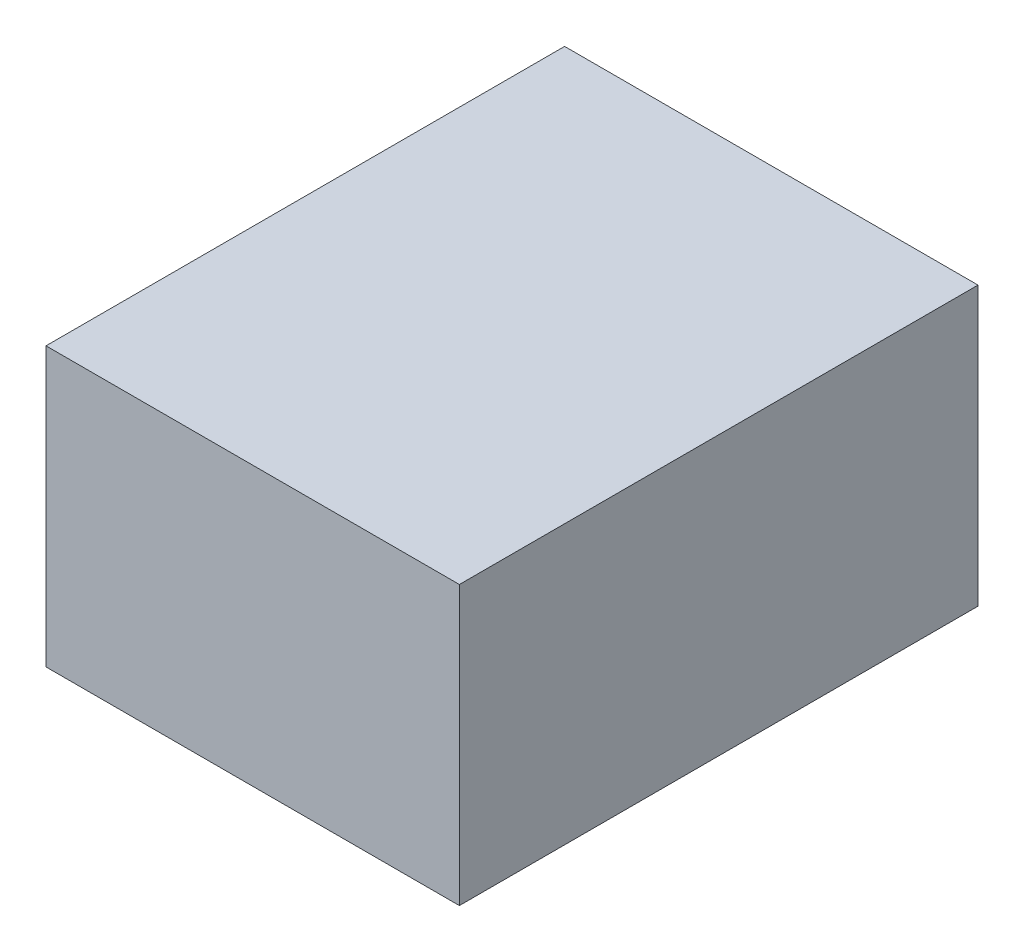
ISO-10303-21;
HEADER;
FILE_DESCRIPTION(('STEP AP214'),'2;1');
FILE_NAME('part.step','',(''),(''),'','','');
FILE_SCHEMA(('AUTOMOTIVE_DESIGN { 1 0 10303 214 1 1 1 1 }'));
ENDSEC;
DATA;
#1=APPLICATION_CONTEXT('core data for automotive mechanical design processes');
#2=APPLICATION_PROTOCOL_DEFINITION('international standard','automotive_design',2000,#1);
#3=PRODUCT_CONTEXT('',#1,'mechanical');
#4=PRODUCT('Part','Part','',(#3));
#5=PRODUCT_RELATED_PRODUCT_CATEGORY('part','',(#4));
#6=PRODUCT_DEFINITION_FORMATION('','',#4);
#7=PRODUCT_DEFINITION_CONTEXT('part definition',#1,'design');
#8=PRODUCT_DEFINITION('design','',#6,#7);
#9=PRODUCT_DEFINITION_SHAPE('','',#8);
#10=(LENGTH_UNIT() NAMED_UNIT(*) SI_UNIT(.MILLI.,.METRE.));
#11=(NAMED_UNIT(*) PLANE_ANGLE_UNIT() SI_UNIT($,.RADIAN.));
#12=(NAMED_UNIT(*) SI_UNIT($,.STERADIAN.) SOLID_ANGLE_UNIT());
#13=UNCERTAINTY_MEASURE_WITH_UNIT(LENGTH_MEASURE(1.E-05),#10,'distance_accuracy_value','');
#14=(GEOMETRIC_REPRESENTATION_CONTEXT(3) GLOBAL_UNCERTAINTY_ASSIGNED_CONTEXT((#13)) GLOBAL_UNIT_ASSIGNED_CONTEXT((#10,
#11,#12)) REPRESENTATION_CONTEXT('',''));
#15=CARTESIAN_POINT('',(0.,0.,0.));
#16=DIRECTION('',(0.,0.,1.));
#17=DIRECTION('',(1.,0.,0.));
#18=AXIS2_PLACEMENT_3D('',#15,#16,#17);
#19=CARTESIAN_POINT('',(-27.5,-18.5,69.));
#20=DIRECTION('',(1.,0.,0.));
#21=DIRECTION('',(0.,1.,0.));
#22=AXIS2_PLACEMENT_3D('',#19,#20,#21);
#23=PLANE('',#22);
#24=DIRECTION('',(0.,-1.,0.));
#25=VECTOR('',#24,1.);
#26=CARTESIAN_POINT('',(-27.5,-18.5,0.));
#27=LINE('',#26,#25);
#28=CARTESIAN_POINT('',(-27.5,18.5,0.));
#29=VERTEX_POINT('',#28);
#30=CARTESIAN_POINT('',(-27.5,-18.5,0.));
#31=VERTEX_POINT('',#30);
#32=EDGE_CURVE('E100',#29,#31,#27,.T.);
#33=ORIENTED_EDGE('',*,*,#32,.T.);
#34=DIRECTION('',(0.,0.,-1.));
#35=VECTOR('',#34,1.);
#36=CARTESIAN_POINT('',(-27.5,-18.5,69.));
#37=LINE('',#36,#35);
#38=CARTESIAN_POINT('',(-27.5,-18.5,69.));
#39=VERTEX_POINT('',#38);
#40=EDGE_CURVE('E11',#39,#31,#37,.T.);
#41=ORIENTED_EDGE('',*,*,#40,.F.);
#42=DIRECTION('',(0.,-1.,0.));
#43=VECTOR('',#42,1.);
#44=CARTESIAN_POINT('',(-27.5,-18.5,69.));
#45=LINE('',#44,#43);
#46=CARTESIAN_POINT('',(-27.5,18.5,69.));
#47=VERTEX_POINT('',#46);
#48=EDGE_CURVE('E88',#47,#39,#45,.T.);
#49=ORIENTED_EDGE('',*,*,#48,.F.);
#50=DIRECTION('',(0.,0.,-1.));
#51=VECTOR('',#50,1.);
#52=CARTESIAN_POINT('',(-27.5,18.5,69.));
#53=LINE('',#52,#51);
#54=EDGE_CURVE('E96',#47,#29,#53,.T.);
#55=ORIENTED_EDGE('',*,*,#54,.T.);
#56=EDGE_LOOP('',(#33,#41,#49,#55));
#57=FACE_BOUND('',#56,.T.);
#58=ADVANCED_FACE('F37',(#57),#23,.F.);
#59=CARTESIAN_POINT('',(27.5,-18.5,69.));
#60=DIRECTION('',(0.,1.,0.));
#61=DIRECTION('',(-1.,0.,0.));
#62=AXIS2_PLACEMENT_3D('',#59,#60,#61);
#63=PLANE('',#62);
#64=DIRECTION('',(1.,0.,0.));
#65=VECTOR('',#64,1.);
#66=CARTESIAN_POINT('',(27.5,-18.5,0.));
#67=LINE('',#66,#65);
#68=CARTESIAN_POINT('',(27.5,-18.5,0.));
#69=VERTEX_POINT('',#68);
#70=EDGE_CURVE('E92',#31,#69,#67,.T.);
#71=ORIENTED_EDGE('',*,*,#70,.T.);
#72=DIRECTION('',(0.,0.,-1.));
#73=VECTOR('',#72,1.);
#74=CARTESIAN_POINT('',(27.5,-18.5,69.));
#75=LINE('',#74,#73);
#76=CARTESIAN_POINT('',(27.5,-18.5,69.));
#77=VERTEX_POINT('',#76);
#78=EDGE_CURVE('E45',#77,#69,#75,.T.);
#79=ORIENTED_EDGE('',*,*,#78,.F.);
#80=DIRECTION('',(1.,0.,0.));
#81=VECTOR('',#80,1.);
#82=CARTESIAN_POINT('',(27.5,-18.5,69.));
#83=LINE('',#82,#81);
#84=EDGE_CURVE('E83',#39,#77,#83,.T.);
#85=ORIENTED_EDGE('',*,*,#84,.F.);
#86=ORIENTED_EDGE('',*,*,#40,.T.);
#87=EDGE_LOOP('',(#71,#79,#85,#86));
#88=FACE_BOUND('',#87,.T.);
#89=ADVANCED_FACE('F91',(#88),#63,.F.);
#90=CARTESIAN_POINT('',(27.5,-18.5,69.));
#91=DIRECTION('',(-1.,0.,0.));
#92=DIRECTION('',(0.,0.,1.));
#93=AXIS2_PLACEMENT_3D('',#90,#91,#92);
#94=PLANE('',#93);
#95=DIRECTION('',(0.,1.,0.));
#96=VECTOR('',#95,1.);
#97=CARTESIAN_POINT('',(27.5,-18.5,0.));
#98=LINE('',#97,#96);
#99=CARTESIAN_POINT('',(27.5,18.5,0.));
#100=VERTEX_POINT('',#99);
#101=EDGE_CURVE('E70',#69,#100,#98,.T.);
#102=ORIENTED_EDGE('',*,*,#101,.T.);
#103=DIRECTION('',(0.,0.,-1.));
#104=VECTOR('',#103,1.);
#105=CARTESIAN_POINT('',(27.5,18.5,69.));
#106=LINE('',#105,#104);
#107=CARTESIAN_POINT('',(27.5,18.5,69.));
#108=VERTEX_POINT('',#107);
#109=EDGE_CURVE('E93',#108,#100,#106,.T.);
#110=ORIENTED_EDGE('',*,*,#109,.F.);
#111=DIRECTION('',(0.,1.,0.));
#112=VECTOR('',#111,1.);
#113=CARTESIAN_POINT('',(27.5,-18.5,69.));
#114=LINE('',#113,#112);
#115=EDGE_CURVE('E86',#77,#108,#114,.T.);
#116=ORIENTED_EDGE('',*,*,#115,.F.);
#117=ORIENTED_EDGE('',*,*,#78,.T.);
#118=EDGE_LOOP('',(#102,#110,#116,#117));
#119=FACE_BOUND('',#118,.T.);
#120=ADVANCED_FACE('F94',(#119),#94,.F.);
#121=CARTESIAN_POINT('',(27.5,18.5,69.));
#122=DIRECTION('',(0.,-1.,0.));
#123=DIRECTION('',(1.,0.,0.));
#124=AXIS2_PLACEMENT_3D('',#121,#122,#123);
#125=PLANE('',#124);
#126=DIRECTION('',(-1.,0.,0.));
#127=VECTOR('',#126,1.);
#128=CARTESIAN_POINT('',(27.5,18.5,0.));
#129=LINE('',#128,#127);
#130=EDGE_CURVE('E76',#100,#29,#129,.T.);
#131=ORIENTED_EDGE('',*,*,#130,.T.);
#132=ORIENTED_EDGE('',*,*,#54,.F.);
#133=DIRECTION('',(-1.,0.,0.));
#134=VECTOR('',#133,1.);
#135=CARTESIAN_POINT('',(27.5,18.5,69.));
#136=LINE('',#135,#134);
#137=EDGE_CURVE('E53',#108,#47,#136,.T.);
#138=ORIENTED_EDGE('',*,*,#137,.F.);
#139=ORIENTED_EDGE('',*,*,#109,.T.);
#140=EDGE_LOOP('',(#131,#132,#138,#139));
#141=FACE_BOUND('',#140,.T.);
#142=ADVANCED_FACE('F107',(#141),#125,.F.);
#143=CARTESIAN_POINT('',(0.,0.,69.));
#144=DIRECTION('',(0.,0.,1.));
#145=DIRECTION('',(1.,0.,0.));
#146=AXIS2_PLACEMENT_3D('',#143,#144,#145);
#147=PLANE('',#146);
#148=ORIENTED_EDGE('',*,*,#48,.T.);
#149=ORIENTED_EDGE('',*,*,#84,.T.);
#150=ORIENTED_EDGE('',*,*,#115,.T.);
#151=ORIENTED_EDGE('',*,*,#137,.T.);
#152=EDGE_LOOP('',(#148,#149,#150,#151));
#153=FACE_BOUND('',#152,.T.);
#154=ADVANCED_FACE('F84',(#153),#147,.T.);
#155=CARTESIAN_POINT('',(0.,0.,0.));
#156=DIRECTION('',(0.,0.,1.));
#157=DIRECTION('',(1.,0.,0.));
#158=AXIS2_PLACEMENT_3D('',#155,#156,#157);
#159=PLANE('',#158);
#160=ORIENTED_EDGE('',*,*,#32,.F.);
#161=ORIENTED_EDGE('',*,*,#130,.F.);
#162=ORIENTED_EDGE('',*,*,#101,.F.);
#163=ORIENTED_EDGE('',*,*,#70,.F.);
#164=EDGE_LOOP('',(#160,#161,#162,#163));
#165=FACE_BOUND('',#164,.T.);
#166=ADVANCED_FACE('F110',(#165),#159,.F.);
#167=CLOSED_SHELL('',(#58,#89,#120,#142,#154,#166));
#168=MANIFOLD_SOLID_BREP('B2',#167);
#169=ADVANCED_BREP_SHAPE_REPRESENTATION('',(#18,#168),#14);
#170=SHAPE_DEFINITION_REPRESENTATION(#9,#169);
ENDSEC;
END-ISO-10303-21;
